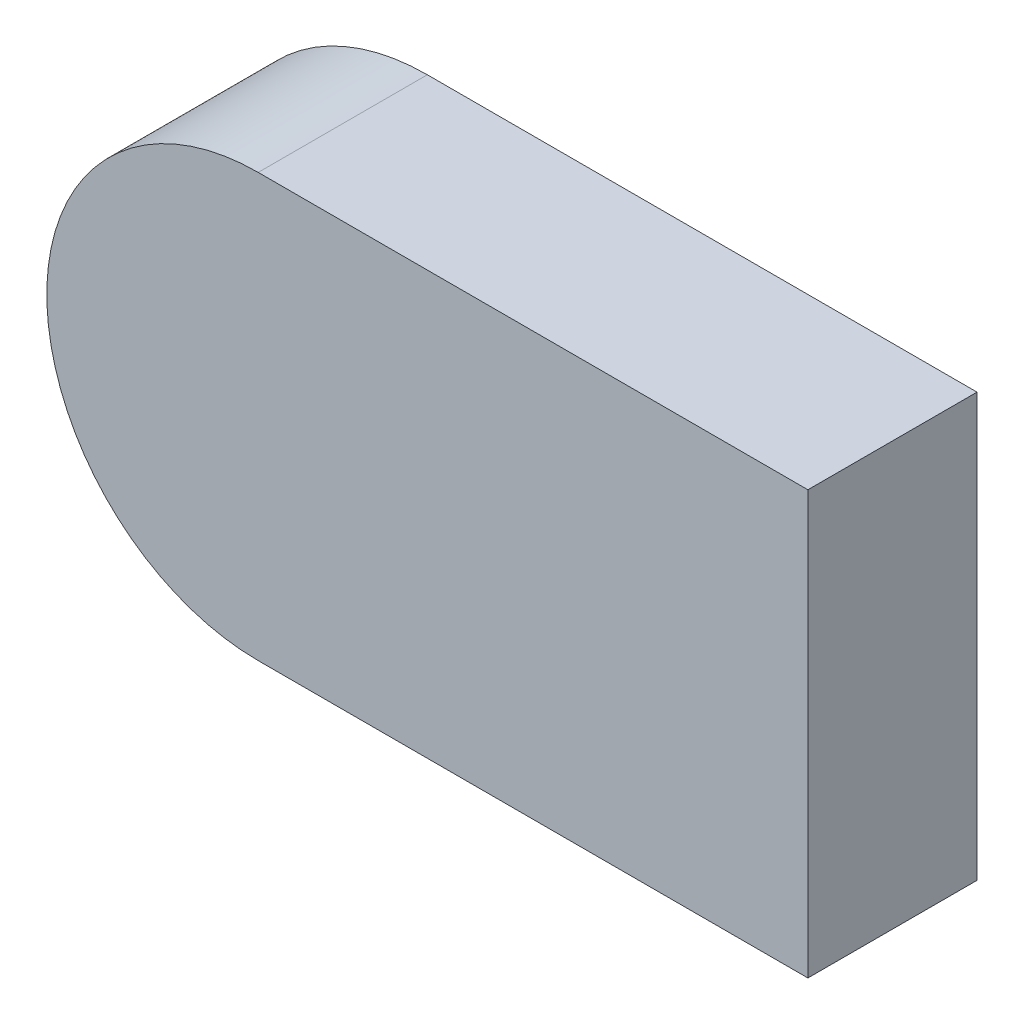
ISO-10303-21;
HEADER;
FILE_DESCRIPTION(('STEP AP214'),'2;1');
FILE_NAME('part.step','',(''),(''),'','','');
FILE_SCHEMA(('AUTOMOTIVE_DESIGN { 1 0 10303 214 1 1 1 1 }'));
ENDSEC;
DATA;
#1=APPLICATION_CONTEXT('core data for automotive mechanical design processes');
#2=APPLICATION_PROTOCOL_DEFINITION('international standard','automotive_design',2000,#1);
#3=PRODUCT_CONTEXT('',#1,'mechanical');
#4=PRODUCT('Part','Part','',(#3));
#5=PRODUCT_RELATED_PRODUCT_CATEGORY('part','',(#4));
#6=PRODUCT_DEFINITION_FORMATION('','',#4);
#7=PRODUCT_DEFINITION_CONTEXT('part definition',#1,'design');
#8=PRODUCT_DEFINITION('design','',#6,#7);
#9=PRODUCT_DEFINITION_SHAPE('','',#8);
#10=(LENGTH_UNIT() NAMED_UNIT(*) SI_UNIT(.MILLI.,.METRE.));
#11=(NAMED_UNIT(*) PLANE_ANGLE_UNIT() SI_UNIT($,.RADIAN.));
#12=(NAMED_UNIT(*) SI_UNIT($,.STERADIAN.) SOLID_ANGLE_UNIT());
#13=UNCERTAINTY_MEASURE_WITH_UNIT(LENGTH_MEASURE(1.E-05),#10,'distance_accuracy_value','');
#14=(GEOMETRIC_REPRESENTATION_CONTEXT(3) GLOBAL_UNCERTAINTY_ASSIGNED_CONTEXT((#13)) GLOBAL_UNIT_ASSIGNED_CONTEXT((#10,
#11,#12)) REPRESENTATION_CONTEXT('',''));
#15=CARTESIAN_POINT('',(0.,0.,0.));
#16=DIRECTION('',(0.,0.,1.));
#17=DIRECTION('',(1.,0.,0.));
#18=AXIS2_PLACEMENT_3D('',#15,#16,#17);
#19=CARTESIAN_POINT('',(2.05,-0.375,0.));
#20=DIRECTION('',(0.,-1.,0.));
#21=DIRECTION('',(-1.,0.,0.));
#22=AXIS2_PLACEMENT_3D('',#19,#20,#21);
#23=PLANE('',#22);
#24=DIRECTION('',(0.,0.,1.));
#25=VECTOR('',#24,1.);
#26=CARTESIAN_POINT('',(2.05,-0.375,0.));
#27=LINE('',#26,#25);
#28=CARTESIAN_POINT('',(2.05,-0.375,0.));
#29=VERTEX_POINT('',#28);
#30=CARTESIAN_POINT('',(2.05,-0.375,0.1));
#31=VERTEX_POINT('',#30);
#32=EDGE_CURVE('E11',#29,#31,#27,.T.);
#33=ORIENTED_EDGE('',*,*,#32,.T.);
#34=DIRECTION('',(-1.,0.,0.));
#35=VECTOR('',#34,1.);
#36=CARTESIAN_POINT('',(2.05,-0.375,0.1));
#37=LINE('',#36,#35);
#38=CARTESIAN_POINT('',(1.725,-0.375,0.1));
#39=VERTEX_POINT('',#38);
#40=EDGE_CURVE('E24',#31,#39,#37,.T.);
#41=ORIENTED_EDGE('',*,*,#40,.T.);
#42=DIRECTION('',(0.,0.,1.));
#43=VECTOR('',#42,1.);
#44=CARTESIAN_POINT('',(1.725,-0.375,0.));
#45=LINE('',#44,#43);
#46=CARTESIAN_POINT('',(1.725,-0.375,0.));
#47=VERTEX_POINT('',#46);
#48=EDGE_CURVE('E86',#47,#39,#45,.T.);
#49=ORIENTED_EDGE('',*,*,#48,.F.);
#50=DIRECTION('',(-1.,0.,0.));
#51=VECTOR('',#50,1.);
#52=CARTESIAN_POINT('',(2.05,-0.375,0.));
#53=LINE('',#52,#51);
#54=EDGE_CURVE('E83',#29,#47,#53,.T.);
#55=ORIENTED_EDGE('',*,*,#54,.F.);
#56=EDGE_LOOP('',(#33,#41,#49,#55));
#57=FACE_BOUND('',#56,.T.);
#58=ADVANCED_FACE('F17',(#57),#23,.T.);
#59=CARTESIAN_POINT('',(1.725,-0.25,0.));
#60=DIRECTION('',(0.,0.,-1.));
#61=DIRECTION('',(1.,0.,0.));
#62=AXIS2_PLACEMENT_3D('',#59,#60,#61);
#63=CYLINDRICAL_SURFACE('',#62,0.125);
#64=CARTESIAN_POINT('',(1.725,-0.25,0.));
#65=DIRECTION('',(0.,0.,1.));
#66=DIRECTION('',(1.,0.,0.));
#67=AXIS2_PLACEMENT_3D('',#64,#65,#66);
#68=CIRCLE('',#67,0.125);
#69=CARTESIAN_POINT('',(1.725,-0.125,0.));
#70=VERTEX_POINT('',#69);
#71=EDGE_CURVE('E80',#70,#47,#68,.T.);
#72=ORIENTED_EDGE('',*,*,#71,.T.);
#73=ORIENTED_EDGE('',*,*,#48,.T.);
#74=CARTESIAN_POINT('',(1.725,-0.25,0.1));
#75=DIRECTION('',(0.,0.,1.));
#76=DIRECTION('',(1.,0.,0.));
#77=AXIS2_PLACEMENT_3D('',#74,#75,#76);
#78=CIRCLE('',#77,0.125);
#79=CARTESIAN_POINT('',(1.725,-0.125,0.1));
#80=VERTEX_POINT('',#79);
#81=EDGE_CURVE('E78',#80,#39,#78,.T.);
#82=ORIENTED_EDGE('',*,*,#81,.F.);
#83=DIRECTION('',(0.,0.,1.));
#84=VECTOR('',#83,1.);
#85=CARTESIAN_POINT('',(1.725,-0.125,0.));
#86=LINE('',#85,#84);
#87=EDGE_CURVE('E67',#70,#80,#86,.T.);
#88=ORIENTED_EDGE('',*,*,#87,.F.);
#89=EDGE_LOOP('',(#72,#73,#82,#88));
#90=FACE_BOUND('',#89,.T.);
#91=ADVANCED_FACE('F89',(#90),#63,.T.);
#92=CARTESIAN_POINT('',(2.05,-0.125,0.));
#93=DIRECTION('',(0.,-1.,0.));
#94=DIRECTION('',(-1.,0.,0.));
#95=AXIS2_PLACEMENT_3D('',#92,#93,#94);
#96=PLANE('',#95);
#97=DIRECTION('',(-1.,0.,0.));
#98=VECTOR('',#97,1.);
#99=CARTESIAN_POINT('',(2.05,-0.125,0.));
#100=LINE('',#99,#98);
#101=CARTESIAN_POINT('',(2.05,-0.125,0.));
#102=VERTEX_POINT('',#101);
#103=EDGE_CURVE('E70',#102,#70,#100,.T.);
#104=ORIENTED_EDGE('',*,*,#103,.T.);
#105=ORIENTED_EDGE('',*,*,#87,.T.);
#106=DIRECTION('',(-1.,0.,0.));
#107=VECTOR('',#106,1.);
#108=CARTESIAN_POINT('',(2.05,-0.125,0.1));
#109=LINE('',#108,#107);
#110=CARTESIAN_POINT('',(2.05,-0.125,0.1));
#111=VERTEX_POINT('',#110);
#112=EDGE_CURVE('E61',#111,#80,#109,.T.);
#113=ORIENTED_EDGE('',*,*,#112,.F.);
#114=DIRECTION('',(0.,0.,1.));
#115=VECTOR('',#114,1.);
#116=CARTESIAN_POINT('',(2.05,-0.125,0.));
#117=LINE('',#116,#115);
#118=EDGE_CURVE('E51',#102,#111,#117,.T.);
#119=ORIENTED_EDGE('',*,*,#118,.F.);
#120=EDGE_LOOP('',(#104,#105,#113,#119));
#121=FACE_BOUND('',#120,.T.);
#122=ADVANCED_FACE('F65',(#121),#96,.F.);
#123=CARTESIAN_POINT('',(2.05,-0.375,0.));
#124=DIRECTION('',(-1.,0.,0.));
#125=DIRECTION('',(0.,1.,0.));
#126=AXIS2_PLACEMENT_3D('',#123,#124,#125);
#127=PLANE('',#126);
#128=DIRECTION('',(0.,1.,0.));
#129=VECTOR('',#128,1.);
#130=CARTESIAN_POINT('',(2.05,-0.375,0.));
#131=LINE('',#130,#129);
#132=EDGE_CURVE('E57',#29,#102,#131,.T.);
#133=ORIENTED_EDGE('',*,*,#132,.T.);
#134=ORIENTED_EDGE('',*,*,#118,.T.);
#135=DIRECTION('',(0.,1.,0.));
#136=VECTOR('',#135,1.);
#137=CARTESIAN_POINT('',(2.05,-0.375,0.1));
#138=LINE('',#137,#136);
#139=EDGE_CURVE('E55',#31,#111,#138,.T.);
#140=ORIENTED_EDGE('',*,*,#139,.F.);
#141=ORIENTED_EDGE('',*,*,#32,.F.);
#142=EDGE_LOOP('',(#133,#134,#140,#141));
#143=FACE_BOUND('',#142,.T.);
#144=ADVANCED_FACE('F53',(#143),#127,.F.);
#145=CARTESIAN_POINT('',(1.850342514613,-0.25,0.));
#146=DIRECTION('',(0.,0.,-1.));
#147=DIRECTION('',(-1.,0.,0.));
#148=AXIS2_PLACEMENT_3D('',#145,#146,#147);
#149=PLANE('',#148);
#150=ORIENTED_EDGE('',*,*,#54,.T.);
#151=ORIENTED_EDGE('',*,*,#71,.F.);
#152=ORIENTED_EDGE('',*,*,#103,.F.);
#153=ORIENTED_EDGE('',*,*,#132,.F.);
#154=EDGE_LOOP('',(#150,#151,#152,#153));
#155=FACE_BOUND('',#154,.T.);
#156=ADVANCED_FACE('F91',(#155),#149,.T.);
#157=CARTESIAN_POINT('',(1.850342514613,-0.25,0.1));
#158=DIRECTION('',(0.,0.,-1.));
#159=DIRECTION('',(-1.,0.,0.));
#160=AXIS2_PLACEMENT_3D('',#157,#158,#159);
#161=PLANE('',#160);
#162=ORIENTED_EDGE('',*,*,#139,.T.);
#163=ORIENTED_EDGE('',*,*,#112,.T.);
#164=ORIENTED_EDGE('',*,*,#81,.T.);
#165=ORIENTED_EDGE('',*,*,#40,.F.);
#166=EDGE_LOOP('',(#162,#163,#164,#165));
#167=FACE_BOUND('',#166,.T.);
#168=ADVANCED_FACE('F72',(#167),#161,.F.);
#169=CLOSED_SHELL('',(#58,#91,#122,#144,#156,#168));
#170=MANIFOLD_SOLID_BREP('B1',#169);
#171=ADVANCED_BREP_SHAPE_REPRESENTATION('',(#18,#170),#14);
#172=SHAPE_DEFINITION_REPRESENTATION(#9,#171);
ENDSEC;
END-ISO-10303-21;
